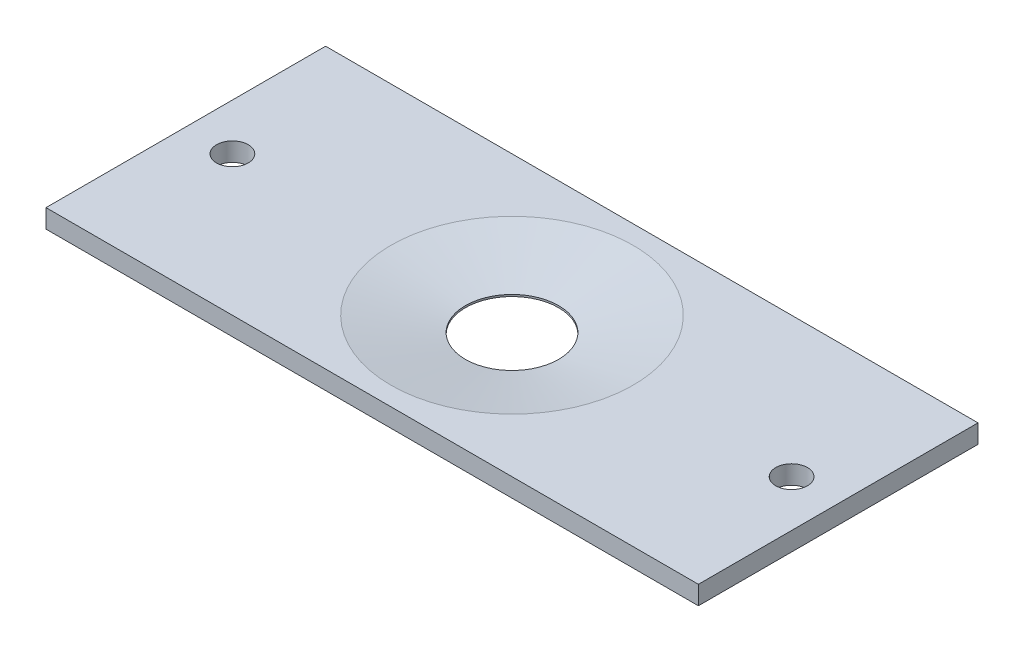
ISO-10303-21;
HEADER;
FILE_DESCRIPTION(('STEP AP214'),'2;1');
FILE_NAME('part.step','',(''),(''),'','','');
FILE_SCHEMA(('AUTOMOTIVE_DESIGN { 1 0 10303 214 1 1 1 1 }'));
ENDSEC;
DATA;
#1=APPLICATION_CONTEXT('core data for automotive mechanical design processes');
#2=APPLICATION_PROTOCOL_DEFINITION('international standard','automotive_design',2000,#1);
#3=PRODUCT_CONTEXT('',#1,'mechanical');
#4=PRODUCT('Part','Part','',(#3));
#5=PRODUCT_RELATED_PRODUCT_CATEGORY('part','',(#4));
#6=PRODUCT_DEFINITION_FORMATION('','',#4);
#7=PRODUCT_DEFINITION_CONTEXT('part definition',#1,'design');
#8=PRODUCT_DEFINITION('design','',#6,#7);
#9=PRODUCT_DEFINITION_SHAPE('','',#8);
#10=(LENGTH_UNIT() NAMED_UNIT(*) SI_UNIT(.MILLI.,.METRE.));
#11=(NAMED_UNIT(*) PLANE_ANGLE_UNIT() SI_UNIT($,.RADIAN.));
#12=(NAMED_UNIT(*) SI_UNIT($,.STERADIAN.) SOLID_ANGLE_UNIT());
#13=UNCERTAINTY_MEASURE_WITH_UNIT(LENGTH_MEASURE(1.E-05),#10,'distance_accuracy_value','');
#14=(GEOMETRIC_REPRESENTATION_CONTEXT(3) GLOBAL_UNCERTAINTY_ASSIGNED_CONTEXT((#13)) GLOBAL_UNIT_ASSIGNED_CONTEXT((#10,
#11,#12)) REPRESENTATION_CONTEXT('',''));
#15=CARTESIAN_POINT('',(0.,0.,0.));
#16=DIRECTION('',(0.,0.,1.));
#17=DIRECTION('',(1.,0.,0.));
#18=AXIS2_PLACEMENT_3D('',#15,#16,#17);
#19=CARTESIAN_POINT('',(0.,2.,0.));
#20=DIRECTION('',(0.,-1.,0.));
#21=DIRECTION('',(0.,0.,-1.));
#22=AXIS2_PLACEMENT_3D('',#19,#20,#21);
#23=CYLINDRICAL_SURFACE('',#22,5.);
#24=CARTESIAN_POINT('',(0.,0.399999999999999,0.));
#25=DIRECTION('',(0.,1.,0.));
#26=DIRECTION('',(0.,0.,1.));
#27=AXIS2_PLACEMENT_3D('',#24,#25,#26);
#28=CIRCLE('',#27,5.);
#29=CARTESIAN_POINT('',(0.,0.399999999999999,5.));
#30=VERTEX_POINT('',#29);
#31=EDGE_CURVE('E42',#30,#30,#28,.T.);
#32=ORIENTED_EDGE('',*,*,#31,.T.);
#33=EDGE_LOOP('',(#32));
#34=FACE_BOUND('',#33,.T.);
#35=CARTESIAN_POINT('',(0.,0.2,0.));
#36=DIRECTION('',(0.,-1.,0.));
#37=DIRECTION('',(0.,0.,-1.));
#38=AXIS2_PLACEMENT_3D('',#35,#36,#37);
#39=CIRCLE('',#38,5.);
#40=CARTESIAN_POINT('',(0.,0.2,-5.));
#41=VERTEX_POINT('',#40);
#42=EDGE_CURVE('E37',#41,#41,#39,.T.);
#43=ORIENTED_EDGE('',*,*,#42,.T.);
#44=EDGE_LOOP('',(#43));
#45=FACE_BOUND('',#44,.T.);
#46=ADVANCED_FACE('F33',(#34,#45),#23,.F.);
#47=CARTESIAN_POINT('',(-35.,2.,15.));
#48=DIRECTION('',(0.,1.,0.));
#49=DIRECTION('',(0.,0.,1.));
#50=AXIS2_PLACEMENT_3D('',#47,#48,#49);
#51=PLANE('',#50);
#52=CARTESIAN_POINT('',(30.,2.,0.));
#53=DIRECTION('',(0.,1.,0.));
#54=DIRECTION('',(0.,0.,1.));
#55=AXIS2_PLACEMENT_3D('',#52,#53,#54);
#56=CIRCLE('',#55,1.69999999999999);
#57=CARTESIAN_POINT('',(30.,2.,1.69999999999999));
#58=VERTEX_POINT('',#57);
#59=EDGE_CURVE('E238',#58,#58,#56,.T.);
#60=ORIENTED_EDGE('',*,*,#59,.F.);
#61=EDGE_LOOP('',(#60));
#62=FACE_BOUND('',#61,.T.);
#63=CARTESIAN_POINT('',(-30.,2.,0.));
#64=DIRECTION('',(0.,1.,0.));
#65=DIRECTION('',(0.,0.,1.));
#66=AXIS2_PLACEMENT_3D('',#63,#64,#65);
#67=CIRCLE('',#66,1.69999999999999);
#68=CARTESIAN_POINT('',(-30.,2.,1.69999999999999));
#69=VERTEX_POINT('',#68);
#70=EDGE_CURVE('E240',#69,#69,#67,.T.);
#71=ORIENTED_EDGE('',*,*,#70,.F.);
#72=EDGE_LOOP('',(#71));
#73=FACE_BOUND('',#72,.T.);
#74=CARTESIAN_POINT('',(0.,2.,0.));
#75=DIRECTION('',(0.,1.,0.));
#76=DIRECTION('',(0.,0.,1.));
#77=AXIS2_PLACEMENT_3D('',#74,#75,#76);
#78=CIRCLE('',#77,13.0000000000001);
#79=CARTESIAN_POINT('',(0.,2.,13.0000000000001));
#80=VERTEX_POINT('',#79);
#81=EDGE_CURVE('E11',#80,#80,#78,.F.);
#82=ORIENTED_EDGE('',*,*,#81,.T.);
#83=EDGE_LOOP('',(#82));
#84=FACE_BOUND('',#83,.T.);
#85=DIRECTION('',(0.,0.,1.));
#86=VECTOR('',#85,1.);
#87=CARTESIAN_POINT('',(-35.,2.,-15.));
#88=LINE('',#87,#86);
#89=CARTESIAN_POINT('',(-35.,2.,-15.));
#90=VERTEX_POINT('',#89);
#91=CARTESIAN_POINT('',(-35.,2.,15.));
#92=VERTEX_POINT('',#91);
#93=EDGE_CURVE('E105',#90,#92,#88,.T.);
#94=ORIENTED_EDGE('',*,*,#93,.T.);
#95=DIRECTION('',(1.,0.,0.));
#96=VECTOR('',#95,1.);
#97=CARTESIAN_POINT('',(-35.,2.,15.));
#98=LINE('',#97,#96);
#99=CARTESIAN_POINT('',(35.,2.,15.));
#100=VERTEX_POINT('',#99);
#101=EDGE_CURVE('E89',#92,#100,#98,.T.);
#102=ORIENTED_EDGE('',*,*,#101,.T.);
#103=DIRECTION('',(0.,0.,-1.));
#104=VECTOR('',#103,1.);
#105=CARTESIAN_POINT('',(35.,2.,-15.));
#106=LINE('',#105,#104);
#107=CARTESIAN_POINT('',(35.,2.,-15.));
#108=VERTEX_POINT('',#107);
#109=EDGE_CURVE('E54',#100,#108,#106,.T.);
#110=ORIENTED_EDGE('',*,*,#109,.T.);
#111=DIRECTION('',(-1.,0.,0.));
#112=VECTOR('',#111,1.);
#113=CARTESIAN_POINT('',(-35.,2.,-15.));
#114=LINE('',#113,#112);
#115=EDGE_CURVE('E49',#108,#90,#114,.T.);
#116=ORIENTED_EDGE('',*,*,#115,.T.);
#117=EDGE_LOOP('',(#94,#102,#110,#116));
#118=FACE_BOUND('',#117,.T.);
#119=ADVANCED_FACE('F139',(#62,#73,#84,#118),#51,.T.);
#120=CARTESIAN_POINT('',(-35.,0.,15.));
#121=DIRECTION('',(0.,1.,0.));
#122=DIRECTION('',(0.,0.,1.));
#123=AXIS2_PLACEMENT_3D('',#120,#121,#122);
#124=PLANE('',#123);
#125=CARTESIAN_POINT('',(30.,0.,0.));
#126=DIRECTION('',(0.,1.,0.));
#127=DIRECTION('',(0.,0.,1.));
#128=AXIS2_PLACEMENT_3D('',#125,#126,#127);
#129=CIRCLE('',#128,1.7);
#130=CARTESIAN_POINT('',(30.,0.,1.7));
#131=VERTEX_POINT('',#130);
#132=EDGE_CURVE('E235',#131,#131,#129,.T.);
#133=ORIENTED_EDGE('',*,*,#132,.T.);
#134=EDGE_LOOP('',(#133));
#135=FACE_BOUND('',#134,.T.);
#136=CARTESIAN_POINT('',(-30.,0.,0.));
#137=DIRECTION('',(0.,1.,0.));
#138=DIRECTION('',(0.,0.,1.));
#139=AXIS2_PLACEMENT_3D('',#136,#137,#138);
#140=CIRCLE('',#139,1.7);
#141=CARTESIAN_POINT('',(-30.,0.,1.7));
#142=VERTEX_POINT('',#141);
#143=EDGE_CURVE('E245',#142,#142,#140,.T.);
#144=ORIENTED_EDGE('',*,*,#143,.T.);
#145=EDGE_LOOP('',(#144));
#146=FACE_BOUND('',#145,.T.);
#147=CARTESIAN_POINT('',(0.,0.,0.));
#148=DIRECTION('',(0.,-1.,0.));
#149=DIRECTION('',(0.,0.,-1.));
#150=AXIS2_PLACEMENT_3D('',#147,#148,#149);
#151=CIRCLE('',#150,5.5);
#152=CARTESIAN_POINT('',(0.,0.,-5.5));
#153=VERTEX_POINT('',#152);
#154=EDGE_CURVE('E247',#153,#153,#151,.T.);
#155=ORIENTED_EDGE('',*,*,#154,.F.);
#156=EDGE_LOOP('',(#155));
#157=FACE_BOUND('',#156,.T.);
#158=DIRECTION('',(0.,0.,1.));
#159=VECTOR('',#158,1.);
#160=CARTESIAN_POINT('',(-35.,0.,-15.));
#161=LINE('',#160,#159);
#162=CARTESIAN_POINT('',(-35.,0.,-15.));
#163=VERTEX_POINT('',#162);
#164=CARTESIAN_POINT('',(-35.,0.,15.));
#165=VERTEX_POINT('',#164);
#166=EDGE_CURVE('E80',#163,#165,#161,.T.);
#167=ORIENTED_EDGE('',*,*,#166,.F.);
#168=DIRECTION('',(-1.,0.,0.));
#169=VECTOR('',#168,1.);
#170=CARTESIAN_POINT('',(-35.,0.,-15.));
#171=LINE('',#170,#169);
#172=CARTESIAN_POINT('',(35.,0.,-15.));
#173=VERTEX_POINT('',#172);
#174=EDGE_CURVE('E103',#173,#163,#171,.T.);
#175=ORIENTED_EDGE('',*,*,#174,.F.);
#176=DIRECTION('',(0.,0.,-1.));
#177=VECTOR('',#176,1.);
#178=CARTESIAN_POINT('',(35.,0.,-15.));
#179=LINE('',#178,#177);
#180=CARTESIAN_POINT('',(35.,0.,15.));
#181=VERTEX_POINT('',#180);
#182=EDGE_CURVE('E81',#181,#173,#179,.T.);
#183=ORIENTED_EDGE('',*,*,#182,.F.);
#184=DIRECTION('',(1.,0.,0.));
#185=VECTOR('',#184,1.);
#186=CARTESIAN_POINT('',(-35.,0.,15.));
#187=LINE('',#186,#185);
#188=EDGE_CURVE('E75',#165,#181,#187,.T.);
#189=ORIENTED_EDGE('',*,*,#188,.F.);
#190=EDGE_LOOP('',(#167,#175,#183,#189));
#191=FACE_BOUND('',#190,.T.);
#192=ADVANCED_FACE('F77',(#135,#146,#157,#191),#124,.F.);
#193=CARTESIAN_POINT('',(-35.,2.,-15.));
#194=DIRECTION('',(1.,0.,0.));
#195=DIRECTION('',(0.,0.,-1.));
#196=AXIS2_PLACEMENT_3D('',#193,#194,#195);
#197=PLANE('',#196);
#198=ORIENTED_EDGE('',*,*,#166,.T.);
#199=DIRECTION('',(0.,-1.,0.));
#200=VECTOR('',#199,1.);
#201=CARTESIAN_POINT('',(-35.,2.,15.));
#202=LINE('',#201,#200);
#203=EDGE_CURVE('E87',#92,#165,#202,.T.);
#204=ORIENTED_EDGE('',*,*,#203,.F.);
#205=ORIENTED_EDGE('',*,*,#93,.F.);
#206=DIRECTION('',(0.,-1.,0.));
#207=VECTOR('',#206,1.);
#208=CARTESIAN_POINT('',(-35.,2.,-15.));
#209=LINE('',#208,#207);
#210=EDGE_CURVE('E95',#90,#163,#209,.T.);
#211=ORIENTED_EDGE('',*,*,#210,.T.);
#212=EDGE_LOOP('',(#198,#204,#205,#211));
#213=FACE_BOUND('',#212,.T.);
#214=ADVANCED_FACE('F35',(#213),#197,.F.);
#215=CARTESIAN_POINT('',(-35.,2.,15.));
#216=DIRECTION('',(0.,0.,-1.));
#217=DIRECTION('',(-1.,0.,0.));
#218=AXIS2_PLACEMENT_3D('',#215,#216,#217);
#219=PLANE('',#218);
#220=ORIENTED_EDGE('',*,*,#188,.T.);
#221=DIRECTION('',(0.,-1.,0.));
#222=VECTOR('',#221,1.);
#223=CARTESIAN_POINT('',(35.,2.,15.));
#224=LINE('',#223,#222);
#225=EDGE_CURVE('E92',#100,#181,#224,.T.);
#226=ORIENTED_EDGE('',*,*,#225,.F.);
#227=ORIENTED_EDGE('',*,*,#101,.F.);
#228=ORIENTED_EDGE('',*,*,#203,.T.);
#229=EDGE_LOOP('',(#220,#226,#227,#228));
#230=FACE_BOUND('',#229,.T.);
#231=ADVANCED_FACE('F88',(#230),#219,.F.);
#232=CARTESIAN_POINT('',(35.,2.,-15.));
#233=DIRECTION('',(-1.,0.,0.));
#234=DIRECTION('',(0.,0.,1.));
#235=AXIS2_PLACEMENT_3D('',#232,#233,#234);
#236=PLANE('',#235);
#237=ORIENTED_EDGE('',*,*,#182,.T.);
#238=DIRECTION('',(0.,-1.,0.));
#239=VECTOR('',#238,1.);
#240=CARTESIAN_POINT('',(35.,2.,-15.));
#241=LINE('',#240,#239);
#242=EDGE_CURVE('E111',#108,#173,#241,.T.);
#243=ORIENTED_EDGE('',*,*,#242,.F.);
#244=ORIENTED_EDGE('',*,*,#109,.F.);
#245=ORIENTED_EDGE('',*,*,#225,.T.);
#246=EDGE_LOOP('',(#237,#243,#244,#245));
#247=FACE_BOUND('',#246,.T.);
#248=ADVANCED_FACE('F133',(#247),#236,.F.);
#249=CARTESIAN_POINT('',(-35.,2.,-15.));
#250=DIRECTION('',(0.,0.,1.));
#251=DIRECTION('',(1.,0.,0.));
#252=AXIS2_PLACEMENT_3D('',#249,#250,#251);
#253=PLANE('',#252);
#254=ORIENTED_EDGE('',*,*,#174,.T.);
#255=ORIENTED_EDGE('',*,*,#210,.F.);
#256=ORIENTED_EDGE('',*,*,#115,.F.);
#257=ORIENTED_EDGE('',*,*,#242,.T.);
#258=EDGE_LOOP('',(#254,#255,#256,#257));
#259=FACE_BOUND('',#258,.T.);
#260=ADVANCED_FACE('F123',(#259),#253,.F.);
#261=CARTESIAN_POINT('',(0.,0.399999999999999,0.));
#262=DIRECTION('',(0.,1.,0.));
#263=DIRECTION('',(0.,0.,1.));
#264=AXIS2_PLACEMENT_3D('',#261,#262,#263);
#265=CONICAL_SURFACE('',#264,5.,1.37340076694502);
#266=ORIENTED_EDGE('',*,*,#81,.F.);
#267=EDGE_LOOP('',(#266));
#268=FACE_BOUND('',#267,.T.);
#269=ORIENTED_EDGE('',*,*,#31,.F.);
#270=EDGE_LOOP('',(#269));
#271=FACE_BOUND('',#270,.T.);
#272=ADVANCED_FACE('F120',(#268,#271),#265,.F.);
#273=CARTESIAN_POINT('',(0.,0.2,0.));
#274=DIRECTION('',(0.,-1.,0.));
#275=DIRECTION('',(0.,0.,-1.));
#276=AXIS2_PLACEMENT_3D('',#273,#274,#275);
#277=CYLINDRICAL_SURFACE('',#276,5.5);
#278=CARTESIAN_POINT('',(0.,0.2,0.));
#279=DIRECTION('',(0.,-1.,0.));
#280=DIRECTION('',(0.,0.,-1.));
#281=AXIS2_PLACEMENT_3D('',#278,#279,#280);
#282=CIRCLE('',#281,5.5);
#283=CARTESIAN_POINT('',(0.,0.2,-5.5));
#284=VERTEX_POINT('',#283);
#285=EDGE_CURVE('E98',#284,#284,#282,.T.);
#286=ORIENTED_EDGE('',*,*,#285,.F.);
#287=EDGE_LOOP('',(#286));
#288=FACE_BOUND('',#287,.T.);
#289=ORIENTED_EDGE('',*,*,#154,.T.);
#290=EDGE_LOOP('',(#289));
#291=FACE_BOUND('',#290,.T.);
#292=ADVANCED_FACE('F122',(#288,#291),#277,.F.);
#293=CARTESIAN_POINT('',(0.,0.2,0.));
#294=DIRECTION('',(0.,-1.,0.));
#295=DIRECTION('',(0.,0.,-1.));
#296=AXIS2_PLACEMENT_3D('',#293,#294,#295);
#297=PLANE('',#296);
#298=ORIENTED_EDGE('',*,*,#42,.F.);
#299=EDGE_LOOP('',(#298));
#300=FACE_BOUND('',#299,.T.);
#301=ORIENTED_EDGE('',*,*,#285,.T.);
#302=EDGE_LOOP('',(#301));
#303=FACE_BOUND('',#302,.T.);
#304=ADVANCED_FACE('F130',(#300,#303),#297,.T.);
#305=CARTESIAN_POINT('',(-30.,2.,0.));
#306=DIRECTION('',(0.,1.,0.));
#307=DIRECTION('',(0.,0.,1.));
#308=AXIS2_PLACEMENT_3D('',#305,#306,#307);
#309=CYLINDRICAL_SURFACE('',#308,1.69999999999999);
#310=ORIENTED_EDGE('',*,*,#143,.F.);
#311=EDGE_LOOP('',(#310));
#312=FACE_BOUND('',#311,.T.);
#313=ORIENTED_EDGE('',*,*,#70,.T.);
#314=EDGE_LOOP('',(#313));
#315=FACE_BOUND('',#314,.T.);
#316=ADVANCED_FACE('F175',(#312,#315),#309,.F.);
#317=CARTESIAN_POINT('',(30.,2.,0.));
#318=DIRECTION('',(0.,1.,0.));
#319=DIRECTION('',(0.,0.,1.));
#320=AXIS2_PLACEMENT_3D('',#317,#318,#319);
#321=CYLINDRICAL_SURFACE('',#320,1.69999999999999);
#322=ORIENTED_EDGE('',*,*,#132,.F.);
#323=EDGE_LOOP('',(#322));
#324=FACE_BOUND('',#323,.T.);
#325=ORIENTED_EDGE('',*,*,#59,.T.);
#326=EDGE_LOOP('',(#325));
#327=FACE_BOUND('',#326,.T.);
#328=ADVANCED_FACE('F218',(#324,#327),#321,.F.);
#329=CLOSED_SHELL('',(#46,#119,#192,#214,#231,#248,#260,#272,#292,#304,#316,#328));
#330=MANIFOLD_SOLID_BREP('B2',#329);
#331=ADVANCED_BREP_SHAPE_REPRESENTATION('',(#18,#330),#14);
#332=SHAPE_DEFINITION_REPRESENTATION(#9,#331);
ENDSEC;
END-ISO-10303-21;
